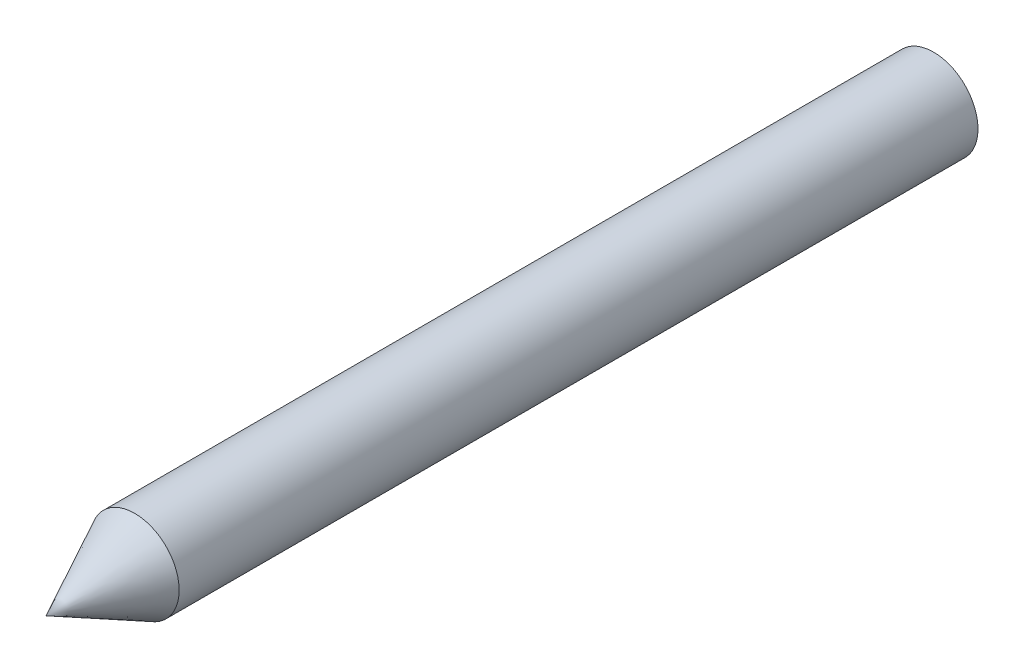
ISO-10303-21;
HEADER;
FILE_DESCRIPTION(('STEP AP214'),'2;1');
FILE_NAME('part.step','',(''),(''),'','','');
FILE_SCHEMA(('AUTOMOTIVE_DESIGN { 1 0 10303 214 1 1 1 1 }'));
ENDSEC;
DATA;
#1=APPLICATION_CONTEXT('core data for automotive mechanical design processes');
#2=APPLICATION_PROTOCOL_DEFINITION('international standard','automotive_design',2000,#1);
#3=PRODUCT_CONTEXT('',#1,'mechanical');
#4=PRODUCT('Part','Part','',(#3));
#5=PRODUCT_RELATED_PRODUCT_CATEGORY('part','',(#4));
#6=PRODUCT_DEFINITION_FORMATION('','',#4);
#7=PRODUCT_DEFINITION_CONTEXT('part definition',#1,'design');
#8=PRODUCT_DEFINITION('design','',#6,#7);
#9=PRODUCT_DEFINITION_SHAPE('','',#8);
#10=(LENGTH_UNIT() NAMED_UNIT(*) SI_UNIT(.MILLI.,.METRE.));
#11=(NAMED_UNIT(*) PLANE_ANGLE_UNIT() SI_UNIT($,.RADIAN.));
#12=(NAMED_UNIT(*) SI_UNIT($,.STERADIAN.) SOLID_ANGLE_UNIT());
#13=UNCERTAINTY_MEASURE_WITH_UNIT(LENGTH_MEASURE(1.E-05),#10,'distance_accuracy_value','');
#14=(GEOMETRIC_REPRESENTATION_CONTEXT(3) GLOBAL_UNCERTAINTY_ASSIGNED_CONTEXT((#13)) GLOBAL_UNIT_ASSIGNED_CONTEXT((#10,
#11,#12)) REPRESENTATION_CONTEXT('',''));
#15=CARTESIAN_POINT('',(0.,0.,0.));
#16=DIRECTION('',(0.,0.,1.));
#17=DIRECTION('',(1.,0.,0.));
#18=AXIS2_PLACEMENT_3D('',#15,#16,#17);
#19=CARTESIAN_POINT('',(0.,0.,450.));
#20=DIRECTION('',(0.,0.,-1.));
#21=DIRECTION('',(-1.,0.,0.));
#22=AXIS2_PLACEMENT_3D('',#19,#20,#21);
#23=CYLINDRICAL_SURFACE('',#22,25.);
#24=CARTESIAN_POINT('',(0.,0.,450.));
#25=DIRECTION('',(0.,0.,1.));
#26=DIRECTION('',(1.,0.,0.));
#27=AXIS2_PLACEMENT_3D('',#24,#25,#26);
#28=CIRCLE('',#27,25.);
#29=CARTESIAN_POINT('',(25.,0.,450.));
#30=VERTEX_POINT('',#29);
#31=EDGE_CURVE('E11',#30,#30,#28,.T.);
#32=ORIENTED_EDGE('',*,*,#31,.F.);
#33=EDGE_LOOP('',(#32));
#34=FACE_BOUND('',#33,.T.);
#35=CARTESIAN_POINT('',(0.,0.,0.));
#36=DIRECTION('',(0.,0.,1.));
#37=DIRECTION('',(1.,0.,0.));
#38=AXIS2_PLACEMENT_3D('',#35,#36,#37);
#39=CIRCLE('',#38,25.);
#40=CARTESIAN_POINT('',(25.,0.,0.));
#41=VERTEX_POINT('',#40);
#42=EDGE_CURVE('E38',#41,#41,#39,.T.);
#43=ORIENTED_EDGE('',*,*,#42,.T.);
#44=EDGE_LOOP('',(#43));
#45=FACE_BOUND('',#44,.T.);
#46=ADVANCED_FACE('F35',(#34,#45),#23,.T.);
#47=CARTESIAN_POINT('',(0.,0.,0.));
#48=DIRECTION('',(0.,0.,1.));
#49=DIRECTION('',(1.,0.,0.));
#50=AXIS2_PLACEMENT_3D('',#47,#48,#49);
#51=PLANE('',#50);
#52=ORIENTED_EDGE('',*,*,#42,.F.);
#53=EDGE_LOOP('',(#52));
#54=FACE_BOUND('',#53,.T.);
#55=ADVANCED_FACE('F47',(#54),#51,.F.);
#56=CARTESIAN_POINT('',(0.,0.,450.));
#57=DIRECTION('',(0.,0.,-1.));
#58=DIRECTION('',(-1.,0.,0.));
#59=AXIS2_PLACEMENT_3D('',#56,#57,#58);
#60=CONICAL_SURFACE('',#59,25.,0.463647609000806);
#61=CARTESIAN_POINT('',(0.,0.,500.));
#62=VERTEX_POINT('',#61);
#63=VERTEX_LOOP('',#62);
#64=FACE_BOUND('',#63,.T.);
#65=ORIENTED_EDGE('',*,*,#31,.T.);
#66=EDGE_LOOP('',(#65));
#67=FACE_BOUND('',#66,.T.);
#68=ADVANCED_FACE('F44',(#64,#67),#60,.T.);
#69=CLOSED_SHELL('',(#46,#55,#68));
#70=MANIFOLD_SOLID_BREP('B2',#69);
#71=ADVANCED_BREP_SHAPE_REPRESENTATION('',(#18,#70),#14);
#72=SHAPE_DEFINITION_REPRESENTATION(#9,#71);
ENDSEC;
END-ISO-10303-21;
